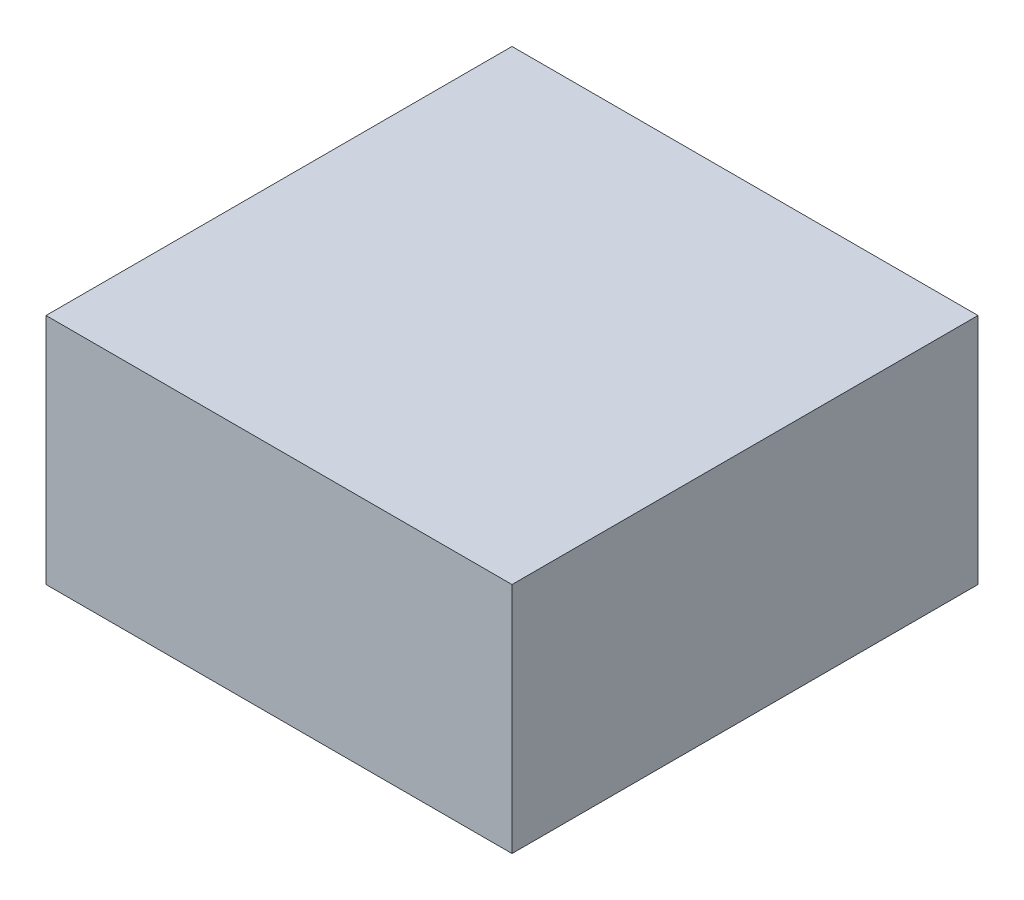
ISO-10303-21;
HEADER;
FILE_DESCRIPTION(('STEP AP214'),'2;1');
FILE_NAME('part.step','',(''),(''),'','','');
FILE_SCHEMA(('AUTOMOTIVE_DESIGN { 1 0 10303 214 1 1 1 1 }'));
ENDSEC;
DATA;
#1=APPLICATION_CONTEXT('core data for automotive mechanical design processes');
#2=APPLICATION_PROTOCOL_DEFINITION('international standard','automotive_design',2000,#1);
#3=PRODUCT_CONTEXT('',#1,'mechanical');
#4=PRODUCT('Part','Part','',(#3));
#5=PRODUCT_RELATED_PRODUCT_CATEGORY('part','',(#4));
#6=PRODUCT_DEFINITION_FORMATION('','',#4);
#7=PRODUCT_DEFINITION_CONTEXT('part definition',#1,'design');
#8=PRODUCT_DEFINITION('design','',#6,#7);
#9=PRODUCT_DEFINITION_SHAPE('','',#8);
#10=(LENGTH_UNIT() NAMED_UNIT(*) SI_UNIT(.MILLI.,.METRE.));
#11=(NAMED_UNIT(*) PLANE_ANGLE_UNIT() SI_UNIT($,.RADIAN.));
#12=(NAMED_UNIT(*) SI_UNIT($,.STERADIAN.) SOLID_ANGLE_UNIT());
#13=UNCERTAINTY_MEASURE_WITH_UNIT(LENGTH_MEASURE(1.E-05),#10,'distance_accuracy_value','');
#14=(GEOMETRIC_REPRESENTATION_CONTEXT(3) GLOBAL_UNCERTAINTY_ASSIGNED_CONTEXT((#13)) GLOBAL_UNIT_ASSIGNED_CONTEXT((#10,
#11,#12)) REPRESENTATION_CONTEXT('',''));
#15=CARTESIAN_POINT('',(0.,0.,0.));
#16=DIRECTION('',(0.,0.,1.));
#17=DIRECTION('',(1.,0.,0.));
#18=AXIS2_PLACEMENT_3D('',#15,#16,#17);
#19=CARTESIAN_POINT('',(100.,-50.,200.));
#20=DIRECTION('',(-1.,0.,0.));
#21=DIRECTION('',(0.,0.,1.));
#22=AXIS2_PLACEMENT_3D('',#19,#20,#21);
#23=PLANE('',#22);
#24=DIRECTION('',(0.,1.,0.));
#25=VECTOR('',#24,1.);
#26=CARTESIAN_POINT('',(100.,-50.,0.));
#27=LINE('',#26,#25);
#28=CARTESIAN_POINT('',(100.,-50.,0.));
#29=VERTEX_POINT('',#28);
#30=CARTESIAN_POINT('',(100.,50.,0.));
#31=VERTEX_POINT('',#30);
#32=EDGE_CURVE('E100',#29,#31,#27,.T.);
#33=ORIENTED_EDGE('',*,*,#32,.T.);
#34=DIRECTION('',(0.,0.,-1.));
#35=VECTOR('',#34,1.);
#36=CARTESIAN_POINT('',(100.,50.,200.));
#37=LINE('',#36,#35);
#38=CARTESIAN_POINT('',(100.,50.,200.));
#39=VERTEX_POINT('',#38);
#40=EDGE_CURVE('E11',#39,#31,#37,.T.);
#41=ORIENTED_EDGE('',*,*,#40,.F.);
#42=DIRECTION('',(0.,1.,0.));
#43=VECTOR('',#42,1.);
#44=CARTESIAN_POINT('',(100.,-50.,200.));
#45=LINE('',#44,#43);
#46=CARTESIAN_POINT('',(100.,-50.,200.));
#47=VERTEX_POINT('',#46);
#48=EDGE_CURVE('E88',#47,#39,#45,.T.);
#49=ORIENTED_EDGE('',*,*,#48,.F.);
#50=DIRECTION('',(0.,0.,-1.));
#51=VECTOR('',#50,1.);
#52=CARTESIAN_POINT('',(100.,-50.,200.));
#53=LINE('',#52,#51);
#54=EDGE_CURVE('E96',#47,#29,#53,.T.);
#55=ORIENTED_EDGE('',*,*,#54,.T.);
#56=EDGE_LOOP('',(#33,#41,#49,#55));
#57=FACE_BOUND('',#56,.T.);
#58=ADVANCED_FACE('F37',(#57),#23,.F.);
#59=CARTESIAN_POINT('',(-100.,50.,200.));
#60=DIRECTION('',(0.,-1.,0.));
#61=DIRECTION('',(0.,0.,-1.));
#62=AXIS2_PLACEMENT_3D('',#59,#60,#61);
#63=PLANE('',#62);
#64=DIRECTION('',(-1.,0.,0.));
#65=VECTOR('',#64,1.);
#66=CARTESIAN_POINT('',(-100.,50.,0.));
#67=LINE('',#66,#65);
#68=CARTESIAN_POINT('',(-100.,50.,0.));
#69=VERTEX_POINT('',#68);
#70=EDGE_CURVE('E92',#31,#69,#67,.T.);
#71=ORIENTED_EDGE('',*,*,#70,.T.);
#72=DIRECTION('',(0.,0.,-1.));
#73=VECTOR('',#72,1.);
#74=CARTESIAN_POINT('',(-100.,50.,200.));
#75=LINE('',#74,#73);
#76=CARTESIAN_POINT('',(-100.,50.,200.));
#77=VERTEX_POINT('',#76);
#78=EDGE_CURVE('E45',#77,#69,#75,.T.);
#79=ORIENTED_EDGE('',*,*,#78,.F.);
#80=DIRECTION('',(-1.,0.,0.));
#81=VECTOR('',#80,1.);
#82=CARTESIAN_POINT('',(-100.,50.,200.));
#83=LINE('',#82,#81);
#84=EDGE_CURVE('E83',#39,#77,#83,.T.);
#85=ORIENTED_EDGE('',*,*,#84,.F.);
#86=ORIENTED_EDGE('',*,*,#40,.T.);
#87=EDGE_LOOP('',(#71,#79,#85,#86));
#88=FACE_BOUND('',#87,.T.);
#89=ADVANCED_FACE('F91',(#88),#63,.F.);
#90=CARTESIAN_POINT('',(-100.,-50.,200.));
#91=DIRECTION('',(1.,0.,0.));
#92=DIRECTION('',(0.,0.,-1.));
#93=AXIS2_PLACEMENT_3D('',#90,#91,#92);
#94=PLANE('',#93);
#95=DIRECTION('',(0.,-1.,0.));
#96=VECTOR('',#95,1.);
#97=CARTESIAN_POINT('',(-100.,-50.,0.));
#98=LINE('',#97,#96);
#99=CARTESIAN_POINT('',(-100.,-50.,0.));
#100=VERTEX_POINT('',#99);
#101=EDGE_CURVE('E70',#69,#100,#98,.T.);
#102=ORIENTED_EDGE('',*,*,#101,.T.);
#103=DIRECTION('',(0.,0.,-1.));
#104=VECTOR('',#103,1.);
#105=CARTESIAN_POINT('',(-100.,-50.,200.));
#106=LINE('',#105,#104);
#107=CARTESIAN_POINT('',(-100.,-50.,200.));
#108=VERTEX_POINT('',#107);
#109=EDGE_CURVE('E93',#108,#100,#106,.T.);
#110=ORIENTED_EDGE('',*,*,#109,.F.);
#111=DIRECTION('',(0.,-1.,0.));
#112=VECTOR('',#111,1.);
#113=CARTESIAN_POINT('',(-100.,-50.,200.));
#114=LINE('',#113,#112);
#115=EDGE_CURVE('E86',#77,#108,#114,.T.);
#116=ORIENTED_EDGE('',*,*,#115,.F.);
#117=ORIENTED_EDGE('',*,*,#78,.T.);
#118=EDGE_LOOP('',(#102,#110,#116,#117));
#119=FACE_BOUND('',#118,.T.);
#120=ADVANCED_FACE('F94',(#119),#94,.F.);
#121=CARTESIAN_POINT('',(-100.,-50.,200.));
#122=DIRECTION('',(0.,1.,0.));
#123=DIRECTION('',(0.,0.,1.));
#124=AXIS2_PLACEMENT_3D('',#121,#122,#123);
#125=PLANE('',#124);
#126=DIRECTION('',(1.,0.,0.));
#127=VECTOR('',#126,1.);
#128=CARTESIAN_POINT('',(-100.,-50.,0.));
#129=LINE('',#128,#127);
#130=EDGE_CURVE('E76',#100,#29,#129,.T.);
#131=ORIENTED_EDGE('',*,*,#130,.T.);
#132=ORIENTED_EDGE('',*,*,#54,.F.);
#133=DIRECTION('',(1.,0.,0.));
#134=VECTOR('',#133,1.);
#135=CARTESIAN_POINT('',(-100.,-50.,200.));
#136=LINE('',#135,#134);
#137=EDGE_CURVE('E53',#108,#47,#136,.T.);
#138=ORIENTED_EDGE('',*,*,#137,.F.);
#139=ORIENTED_EDGE('',*,*,#109,.T.);
#140=EDGE_LOOP('',(#131,#132,#138,#139));
#141=FACE_BOUND('',#140,.T.);
#142=ADVANCED_FACE('F107',(#141),#125,.F.);
#143=CARTESIAN_POINT('',(0.,0.,200.));
#144=DIRECTION('',(0.,0.,-1.));
#145=DIRECTION('',(-1.,0.,0.));
#146=AXIS2_PLACEMENT_3D('',#143,#144,#145);
#147=PLANE('',#146);
#148=ORIENTED_EDGE('',*,*,#48,.T.);
#149=ORIENTED_EDGE('',*,*,#84,.T.);
#150=ORIENTED_EDGE('',*,*,#115,.T.);
#151=ORIENTED_EDGE('',*,*,#137,.T.);
#152=EDGE_LOOP('',(#148,#149,#150,#151));
#153=FACE_BOUND('',#152,.T.);
#154=ADVANCED_FACE('F84',(#153),#147,.F.);
#155=CARTESIAN_POINT('',(0.,0.,0.));
#156=DIRECTION('',(0.,0.,-1.));
#157=DIRECTION('',(-1.,0.,0.));
#158=AXIS2_PLACEMENT_3D('',#155,#156,#157);
#159=PLANE('',#158);
#160=ORIENTED_EDGE('',*,*,#32,.F.);
#161=ORIENTED_EDGE('',*,*,#130,.F.);
#162=ORIENTED_EDGE('',*,*,#101,.F.);
#163=ORIENTED_EDGE('',*,*,#70,.F.);
#164=EDGE_LOOP('',(#160,#161,#162,#163));
#165=FACE_BOUND('',#164,.T.);
#166=ADVANCED_FACE('F110',(#165),#159,.T.);
#167=CLOSED_SHELL('',(#58,#89,#120,#142,#154,#166));
#168=MANIFOLD_SOLID_BREP('B2',#167);
#169=ADVANCED_BREP_SHAPE_REPRESENTATION('',(#18,#168),#14);
#170=SHAPE_DEFINITION_REPRESENTATION(#9,#169);
ENDSEC;
END-ISO-10303-21;
